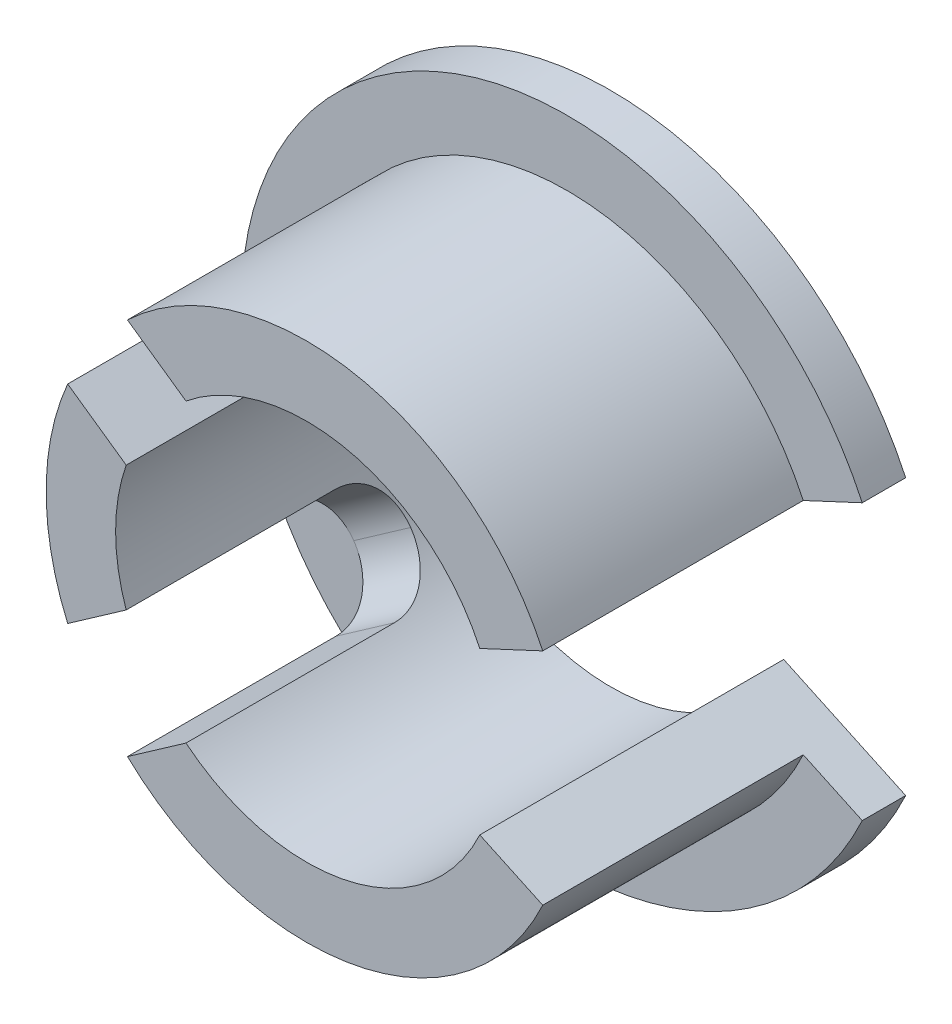
ISO-10303-21;
HEADER;
FILE_DESCRIPTION(('STEP AP214'),'2;1');
FILE_NAME('part.step','',(''),(''),'','','');
FILE_SCHEMA(('AUTOMOTIVE_DESIGN { 1 0 10303 214 1 1 1 1 }'));
ENDSEC;
DATA;
#1=APPLICATION_CONTEXT('core data for automotive mechanical design processes');
#2=APPLICATION_PROTOCOL_DEFINITION('international standard','automotive_design',2000,#1);
#3=PRODUCT_CONTEXT('',#1,'mechanical');
#4=PRODUCT('Part','Part','',(#3));
#5=PRODUCT_RELATED_PRODUCT_CATEGORY('part','',(#4));
#6=PRODUCT_DEFINITION_FORMATION('','',#4);
#7=PRODUCT_DEFINITION_CONTEXT('part definition',#1,'design');
#8=PRODUCT_DEFINITION('design','',#6,#7);
#9=PRODUCT_DEFINITION_SHAPE('','',#8);
#10=(LENGTH_UNIT() NAMED_UNIT(*) SI_UNIT(.MILLI.,.METRE.));
#11=(NAMED_UNIT(*) PLANE_ANGLE_UNIT() SI_UNIT($,.RADIAN.));
#12=(NAMED_UNIT(*) SI_UNIT($,.STERADIAN.) SOLID_ANGLE_UNIT());
#13=UNCERTAINTY_MEASURE_WITH_UNIT(LENGTH_MEASURE(1.E-05),#10,'distance_accuracy_value','');
#14=(GEOMETRIC_REPRESENTATION_CONTEXT(3) GLOBAL_UNCERTAINTY_ASSIGNED_CONTEXT((#13)) GLOBAL_UNIT_ASSIGNED_CONTEXT((#10,
#11,#12)) REPRESENTATION_CONTEXT('',''));
#15=CARTESIAN_POINT('',(0.,0.,0.));
#16=DIRECTION('',(0.,0.,1.));
#17=DIRECTION('',(1.,0.,0.));
#18=AXIS2_PLACEMENT_3D('',#15,#16,#17);
#19=CARTESIAN_POINT('',(0.,0.,6.));
#20=DIRECTION('',(0.,0.,-1.));
#21=DIRECTION('',(-1.,0.,0.));
#22=AXIS2_PLACEMENT_3D('',#19,#20,#21);
#23=CYLINDRICAL_SURFACE('',#22,6.);
#24=DIRECTION('',(0.,0.,-1.));
#25=VECTOR('',#24,1.);
#26=CARTESIAN_POINT('',(-4.12731914901655,4.35490948725243,6.));
#27=LINE('',#26,#25);
#28=CARTESIAN_POINT('',(-4.12731914901656,4.35490948725243,6.));
#29=VERTEX_POINT('',#28);
#30=CARTESIAN_POINT('',(-4.12731914901655,4.35490948725243,1.2));
#31=VERTEX_POINT('',#30);
#32=EDGE_CURVE('E290',#29,#31,#27,.T.);
#33=ORIENTED_EDGE('',*,*,#32,.F.);
#34=CARTESIAN_POINT('',(0.,0.,6.));
#35=DIRECTION('',(0.,0.,1.));
#36=DIRECTION('',(1.,0.,0.));
#37=AXIS2_PLACEMENT_3D('',#34,#35,#36);
#38=CIRCLE('',#37,6.);
#39=CARTESIAN_POINT('',(5.4378467222199,2.53570957044419,6.));
#40=VERTEX_POINT('',#39);
#41=EDGE_CURVE('E323',#40,#29,#38,.T.);
#42=ORIENTED_EDGE('',*,*,#41,.F.);
#43=DIRECTION('',(0.,0.,-1.));
#44=VECTOR('',#43,1.);
#45=CARTESIAN_POINT('',(5.4378467222199,2.53570957044419,6.));
#46=LINE('',#45,#44);
#47=CARTESIAN_POINT('',(5.43784672221998,2.5357095704442,0.));
#48=VERTEX_POINT('',#47);
#49=EDGE_CURVE('E185',#40,#48,#46,.T.);
#50=ORIENTED_EDGE('',*,*,#49,.T.);
#51=CARTESIAN_POINT('',(0.,0.,0.));
#52=DIRECTION('',(0.,0.,1.));
#53=DIRECTION('',(1.,0.,0.));
#54=AXIS2_PLACEMENT_3D('',#51,#52,#53);
#55=CIRCLE('',#54,6.);
#56=CARTESIAN_POINT('',(-4.91491226573395,3.44145861810628,0.));
#57=VERTEX_POINT('',#56);
#58=EDGE_CURVE('E186',#48,#57,#55,.T.);
#59=ORIENTED_EDGE('',*,*,#58,.T.);
#60=CARTESIAN_POINT('',(-4.91491226573395,3.44145861810628,0.));
#61=CARTESIAN_POINT('',(-4.89575145032598,3.46882579019035,-1.59771084222315E-07));
#62=CARTESIAN_POINT('',(-4.87636861824559,3.49601758269154,0.00139600961325699));
#63=CARTESIAN_POINT('',(-4.83729433267939,3.54988562956387,0.00696337264434701));
#64=CARTESIAN_POINT('',(-4.81760291606424,3.57656194468808,0.0111342371933441));
#65=CARTESIAN_POINT('',(-4.75835835430503,3.65545188131099,0.0277558787015132));
#66=CARTESIAN_POINT('',(-4.71854021499501,3.70666143818073,0.0443159057384285));
#67=CARTESIAN_POINT('',(-4.63962162793902,3.80498331681775,0.0878881215790612));
#68=CARTESIAN_POINT('',(-4.60052128919286,3.8520950203103,0.114901884279739));
#69=CARTESIAN_POINT('',(-4.52440989272803,3.94121178417932,0.178592168364046));
#70=CARTESIAN_POINT('',(-4.48739907621217,3.98321625564837,0.215269802533157));
#71=CARTESIAN_POINT('',(-4.41644252202698,4.0617576610809,0.29776354323522));
#72=CARTESIAN_POINT('',(-4.38253882352298,4.09822305281015,0.343683880799866));
#73=CARTESIAN_POINT('',(-4.31967543669473,4.16443190637797,0.443144716802443));
#74=CARTESIAN_POINT('',(-4.29071674648372,4.19417401156235,0.496686749633547));
#75=CARTESIAN_POINT('',(-4.23877070885304,4.24666978285593,0.610475385188785));
#76=CARTESIAN_POINT('',(-4.215841701988,4.26935553373821,0.670779974596941));
#77=CARTESIAN_POINT('',(-4.17742223680119,4.30695605382336,0.795985141129957));
#78=CARTESIAN_POINT('',(-4.16192645327083,4.32187638687429,0.860882389680752));
#79=CARTESIAN_POINT('',(-4.14285537171515,4.34014556287068,0.971789197498264));
#80=CARTESIAN_POINT('',(-4.13704228704735,4.3456795559701,1.01707779734613));
#81=CARTESIAN_POINT('',(-4.12926990479884,4.3530607429089,1.10823688766553));
#82=CARTESIAN_POINT('',(-4.12730689641615,4.35491148678339,1.15410677490711));
#83=CARTESIAN_POINT('',(-4.12731914901655,4.35490948725243,1.2));
#84=B_SPLINE_CURVE_WITH_KNOTS('',3,(#60,#61,#62,#63,#64,#65,#66,#67,#68,#69,#70,#71,#72,#73,#74,
#75,#76,#77,#78,#79,#80,#81,#82,#83),.UNSPECIFIED.,.F.,.F.,(4,2,2,2,2,2,2,2,2,2,2,4),(0.,
0.100161626240136,0.200311374746478,0.400122720254603,0.599964160736359,0.799828622831668,
1.0020878512882,1.20438785613811,1.40857864720857,1.61262293541136,1.75031180360672,
1.88786789840738),.UNSPECIFIED.);
#85=EDGE_CURVE('E260',#57,#31,#84,.T.);
#86=ORIENTED_EDGE('',*,*,#85,.T.);
#87=EDGE_LOOP('',(#33,#42,#50,#59,#86));
#88=FACE_BOUND('',#87,.T.);
#89=ADVANCED_FACE('F38',(#88),#23,.T.);
#90=CARTESIAN_POINT('',(-5.50390259625907,2.38894458095885,6.));
#91=VERTEX_POINT('',#90);
#92=CARTESIAN_POINT('',(-5.50390259625914,-2.3889445809589,6.));
#93=VERTEX_POINT('',#92);
#94=EDGE_CURVE('E289',#91,#93,#38,.T.);
#95=ORIENTED_EDGE('',*,*,#94,.F.);
#96=DIRECTION('',(0.,0.,-1.));
#97=VECTOR('',#96,1.);
#98=CARTESIAN_POINT('',(-5.50390259625907,2.38894458095885,6.));
#99=LINE('',#98,#97);
#100=CARTESIAN_POINT('',(-5.50390259625907,2.38894458095885,1.2));
#101=VERTEX_POINT('',#100);
#102=EDGE_CURVE('E166',#91,#101,#99,.T.);
#103=ORIENTED_EDGE('',*,*,#102,.T.);
#104=CARTESIAN_POINT('',(-5.50390259625907,2.38894458095885,1.2));
#105=CARTESIAN_POINT('',(-5.50390129259065,2.38894345077499,1.16659870671718));
#106=CARTESIAN_POINT('',(-5.50333568249593,2.39025114416916,1.13321375465329));
#107=CARTESIAN_POINT('',(-5.50107139173821,2.39545935136833,1.06668951971157));
#108=CARTESIAN_POINT('',(-5.49937285136066,2.39935954415608,1.03355020693102));
#109=CARTESIAN_POINT('',(-5.49258213134487,2.41488654343475,0.93497014502562));
#110=CARTESIAN_POINT('',(-5.48579487721516,2.43034003994238,0.870200379803861));
#111=CARTESIAN_POINT('',(-5.46768118655352,2.47081922280248,0.744429729103898));
#112=CARTESIAN_POINT('',(-5.45635417239523,2.4958461272301,0.683429324368956));
#113=CARTESIAN_POINT('',(-5.4291419956572,2.55449773971153,0.566803623035975));
#114=CARTESIAN_POINT('',(-5.41325623909368,2.58812356810454,0.51117902814529));
#115=CARTESIAN_POINT('',(-5.37671305831478,2.66321556690927,0.406129110511558));
#116=CARTESIAN_POINT('',(-5.35599833416981,2.70477470554033,0.356790206461739));
#117=CARTESIAN_POINT('',(-5.30999572208968,2.79400432190847,0.266456004446862));
#118=CARTESIAN_POINT('',(-5.28470697172865,2.84167595165242,0.225462283057131));
#119=CARTESIAN_POINT('',(-5.22954064099911,2.94197318512805,0.152643414537148));
#120=CARTESIAN_POINT('',(-5.19962395927408,2.99463936483645,0.120903746376848));
#121=CARTESIAN_POINT('',(-5.13581334917512,3.10279744700854,0.0680561743011082));
#122=CARTESIAN_POINT('',(-5.10192223172316,3.15828733686545,0.0469408115924753));
#123=CARTESIAN_POINT('',(-5.04243943833129,3.25204706793954,0.0210222271502228));
#124=CARTESIAN_POINT('',(-5.0177283325669,3.29005485945234,0.0131482208937326));
#125=CARTESIAN_POINT('',(-4.96713428585142,3.36595884608023,0.00263537222736853));
#126=CARTESIAN_POINT('',(-4.94125252595846,3.40385511432645,-8.63126073076088E-06));
#127=CARTESIAN_POINT('',(-4.91491226573395,3.44145861810628,0.));
#128=B_SPLINE_CURVE_WITH_KNOTS('',3,(#104,#105,#106,#107,#108,#109,#110,#111,#112,#113,#114,
#115,#116,#117,#118,#119,#120,#121,#122,#123,#124,#125,#126,#127),.UNSPECIFIED.,.F.,.F.,(4,2,2,
2,2,2,2,2,2,2,2,4),(0.,0.100141242952308,0.200270088185873,0.400033576783349,0.599822490800818,
0.799637448249877,1.00195631609977,1.20431337071424,1.40848431084597,1.6125117120772,
1.75025786626582,1.88786802166453),.UNSPECIFIED.);
#129=EDGE_CURVE('E11',#101,#57,#128,.T.);
#130=ORIENTED_EDGE('',*,*,#129,.T.);
#131=CARTESIAN_POINT('',(-4.91491226573395,-3.44145861810628,0.));
#132=VERTEX_POINT('',#131);
#133=EDGE_CURVE('E190',#57,#132,#55,.T.);
#134=ORIENTED_EDGE('',*,*,#133,.T.);
#135=CARTESIAN_POINT('',(-4.91491226573395,-3.44145861810628,0.));
#136=CARTESIAN_POINT('',(-4.93407561056105,-3.41409321714057,-1.59771084213976E-07));
#137=CARTESIAN_POINT('',(-4.95299821831417,-3.38657917209615,0.00139600961325702));
#138=CARTESIAN_POINT('',(-4.99025343170655,-3.33143739717516,0.0069633726443471));
#139=CARTESIAN_POINT('',(-5.00858610704553,-3.30380968116691,0.0111342371933442));
#140=CARTESIAN_POINT('',(-5.0624555648402,-3.22115605622935,0.0277558787015134));
#141=CARTESIAN_POINT('',(-5.09695820183063,-3.16622454456607,0.0443159057384286));
#142=CARTESIAN_POINT('',(-5.1623587991917,-3.05843726764323,0.0878881215790616));
#143=CARTESIAN_POINT('',(-5.19325621585426,-3.00558181627239,0.114901884279739));
#144=CARTESIAN_POINT('',(-5.25096695052268,-2.90358077030547,0.178592168364047));
#145=CARTESIAN_POINT('',(-5.2777797976328,-2.8544356037841,0.215269802533158));
#146=CARTESIAN_POINT('',(-5.32731600591159,-2.76089551067685,0.297763543235221));
#147=CARTESIAN_POINT('',(-5.34998651761203,-2.71656455686963,0.343683880799868));
#148=CARTESIAN_POINT('',(-5.39070194416746,-2.63484753456282,0.443144716802445));
#149=CARTESIAN_POINT('',(-5.40874592555937,-2.59746286798594,0.496686749633549));
#150=CARTESIAN_POINT('',(-5.44030922323077,-2.5306949485235,0.610475385188786));
#151=CARTESIAN_POINT('',(-5.45378467371754,-2.50138974620226,0.670779974596943));
#152=CARTESIAN_POINT('',(-5.47597737398958,-2.45242712300303,0.79598514112996));
#153=CARTESIAN_POINT('',(-5.48469803075321,-2.43276279511771,0.860882389680754));
#154=CARTESIAN_POINT('',(-5.4953427465778,-2.40859341431671,0.971789197498266));
#155=CARTESIAN_POINT('',(-5.49855480700557,-2.40123816443734,1.01707779734614));
#156=CARTESIAN_POINT('',(-5.50283254261398,-2.39140999957777,1.10823688766553));
#157=CARTESIAN_POINT('',(-5.50390028456741,-2.3889323834008,1.15410677490711));
#158=CARTESIAN_POINT('',(-5.50390259625907,-2.38894458095885,1.2));
#159=B_SPLINE_CURVE_WITH_KNOTS('',3,(#135,#136,#137,#138,#139,#140,#141,#142,#143,#144,#145,
#146,#147,#148,#149,#150,#151,#152,#153,#154,#155,#156,#157,#158),.UNSPECIFIED.,.F.,.F.,(4,2,2,
2,2,2,2,2,2,2,2,4),(0.,0.100161626240137,0.200311374746479,0.400122720254604,0.599964160736361,
0.799828622831671,1.00208785128821,1.20438785613811,1.40857864720857,1.61262293541137,
1.75031180360672,1.88786789840738),.UNSPECIFIED.);
#160=CARTESIAN_POINT('',(-5.50390259625907,-2.38894458095885,1.2));
#161=VERTEX_POINT('',#160);
#162=EDGE_CURVE('E249',#132,#161,#159,.T.);
#163=ORIENTED_EDGE('',*,*,#162,.T.);
#164=DIRECTION('',(0.,0.,-1.));
#165=VECTOR('',#164,1.);
#166=CARTESIAN_POINT('',(-5.50390259625907,-2.38894458095885,6.));
#167=LINE('',#166,#165);
#168=EDGE_CURVE('E291',#93,#161,#167,.T.);
#169=ORIENTED_EDGE('',*,*,#168,.F.);
#170=EDGE_LOOP('',(#95,#103,#130,#134,#163,#169));
#171=FACE_BOUND('',#170,.T.);
#172=ADVANCED_FACE('F287',(#171),#23,.T.);
#173=CARTESIAN_POINT('',(0.,0.,6.));
#174=DIRECTION('',(0.,0.,-1.));
#175=DIRECTION('',(-1.,0.,0.));
#176=AXIS2_PLACEMENT_3D('',#173,#174,#175);
#177=CYLINDRICAL_SURFACE('',#176,4.4);
#178=CARTESIAN_POINT('',(-2.77934442860093,3.41104742670128,1.2));
#179=CARTESIAN_POINT('',(-2.77934208946984,3.41104642956213,1.16691195953624));
#180=CARTESIAN_POINT('',(-2.78044806810827,3.41014847760911,1.13384042834089));
#181=CARTESIAN_POINT('',(-2.78484395007547,3.40656075451807,1.06794689740856));
#182=CARTESIAN_POINT('',(-2.78813343293852,3.40387132835431,1.0351248508602));
#183=CARTESIAN_POINT('',(-2.80120111840937,3.3931411334644,0.937544671921817));
#184=CARTESIAN_POINT('',(-2.81417899722576,3.38243838194847,0.873460528770743));
#185=CARTESIAN_POINT('',(-2.84792548475399,3.35407205281836,0.74905508034611));
#186=CARTESIAN_POINT('',(-2.8686926425793,3.33640977150477,0.688733076748609));
#187=CARTESIAN_POINT('',(-2.91692919400609,3.29432020048991,0.573332670102652));
#188=CARTESIAN_POINT('',(-2.94440116899407,3.26989030473446,0.518256298028636));
#189=CARTESIAN_POINT('',(-3.00544928293861,3.21388022756531,0.413513253252814));
#190=CARTESIAN_POINT('',(-3.03915346586474,3.18214579574924,0.364003738299508));
#191=CARTESIAN_POINT('',(-3.11070271905138,3.11223812241796,0.273181489355954));
#192=CARTESIAN_POINT('',(-3.14854858002071,3.07406365064597,0.231870324804786));
#193=CARTESIAN_POINT('',(-3.22746681374527,2.99111800455882,0.157949414295823));
#194=CARTESIAN_POINT('',(-3.26858328679814,2.94624520715162,0.125500508132034));
#195=CARTESIAN_POINT('',(-3.35176078194022,2.85125808730684,0.071286701254344));
#196=CARTESIAN_POINT('',(-3.3938210074928,2.80114806346305,0.0495131207399413));
#197=CARTESIAN_POINT('',(-3.46430369789177,2.71306548347898,0.0223579106088473));
#198=CARTESIAN_POINT('',(-3.49291655628263,2.67613876857479,0.0139883088491053));
#199=CARTESIAN_POINT('',(-3.54931979753605,2.60087810735488,0.00280501864488711));
#200=CARTESIAN_POINT('',(-3.57711063165497,2.56254496001483,-1.17759816311641E-05));
#201=CARTESIAN_POINT('',(-3.60426899487156,2.52373631994461,0.));
#202=B_SPLINE_CURVE_WITH_KNOTS('',3,(#178,#179,#180,#181,#182,#183,#184,#185,#186,#187,#188,
#189,#190,#191,#192,#193,#194,#195,#196,#197,#198,#199,#200,#201),.UNSPECIFIED.,.F.,.F.,(4,2,2,
2,2,2,2,2,2,2,2,4),(0.,0.0992010519358643,0.198383006795375,0.396119348186892,0.593818876076946,
0.791594639631131,0.99400858293105,1.19646123774567,1.40237514714957,1.60812135507258,
1.75016366653038,1.89212649843722),.UNSPECIFIED.);
#203=CARTESIAN_POINT('',(-2.77934442860091,3.4110474267013,1.2));
#204=VERTEX_POINT('',#203);
#205=CARTESIAN_POINT('',(-3.60426899487156,2.52373631994461,0.));
#206=VERTEX_POINT('',#205);
#207=EDGE_CURVE('E56',#204,#206,#202,.T.);
#208=ORIENTED_EDGE('',*,*,#207,.T.);
#209=CARTESIAN_POINT('',(-3.60426899487156,2.5237363199446,0.));
#210=CARTESIAN_POINT('',(-3.62326249476011,2.49661435727148,-4.62801717651386E-07));
#211=CARTESIAN_POINT('',(-3.64193668327681,2.46928886880967,0.00137132246412852));
#212=CARTESIAN_POINT('',(-3.6785407757348,2.41441973972067,0.00683941098958863));
#213=CARTESIAN_POINT('',(-3.69647080894635,2.38687613798113,0.0109352389222312));
#214=CARTESIAN_POINT('',(-3.74888899283531,2.30435558251759,0.0272462440025316));
#215=CARTESIAN_POINT('',(-3.78212256640281,2.24932083714262,0.0434852314055239));
#216=CARTESIAN_POINT('',(-3.84449593019729,2.14097417626109,0.086159192208548));
#217=CARTESIAN_POINT('',(-3.873636155105,2.08766207828688,0.112593081873575));
#218=CARTESIAN_POINT('',(-3.92753797548014,1.98439909597685,0.174865098744966));
#219=CARTESIAN_POINT('',(-3.95229810953143,1.93444933691508,0.21070635484722));
#220=CARTESIAN_POINT('',(-3.99783874907871,1.83852368274244,0.291677724617291));
#221=CARTESIAN_POINT('',(-4.01852202351607,1.7926565864676,0.336991324501284));
#222=CARTESIAN_POINT('',(-4.05533936057842,1.70773801414955,0.435237163313999));
#223=CARTESIAN_POINT('',(-4.07147234759386,1.66868815041249,0.48817119912353));
#224=CARTESIAN_POINT('',(-4.09963709485411,1.59826320182644,0.601338516059686));
#225=CARTESIAN_POINT('',(-4.11158810146305,1.56704222192128,0.661687987042844));
#226=CARTESIAN_POINT('',(-4.13118476685181,1.51462866130817,0.787221432559325));
#227=CARTESIAN_POINT('',(-4.13883414289057,1.49342742456457,0.852401177700124));
#228=CARTESIAN_POINT('',(-4.14827613242274,1.46694888803523,0.964930002556443));
#229=CARTESIAN_POINT('',(-4.15114999820712,1.45877070953072,1.01152728918365));
#230=CARTESIAN_POINT('',(-4.15497270621325,1.44782964872516,1.105407459274));
#231=CARTESIAN_POINT('',(-4.15592246347301,1.44506419234596,1.15269000607143));
#232=CARTESIAN_POINT('',(-4.1559278758434,1.44508252040766,1.2));
#233=B_SPLINE_CURVE_WITH_KNOTS('',3,(#209,#210,#211,#212,#213,#214,#215,#216,#217,#218,#219,
#220,#221,#222,#223,#224,#225,#226,#227,#228,#229,#230,#231,#232),.UNSPECIFIED.,.F.,.F.,(4,2,2,
2,2,2,2,2,2,2,2,4),(0.,0.0992708532977199,0.1985243890479,0.396424641270461,0.594303862164045,
0.792248981392049,0.994458695968138,1.19671616945342,1.40268781625164,1.6084811978215,
1.7503374134892,1.89212615150302),.UNSPECIFIED.);
#234=CARTESIAN_POINT('',(-4.15592787584339,1.44508252040767,1.2));
#235=VERTEX_POINT('',#234);
#236=EDGE_CURVE('E48',#206,#235,#233,.T.);
#237=ORIENTED_EDGE('',*,*,#236,.T.);
#238=DIRECTION('',(0.,0.,1.));
#239=VECTOR('',#238,1.);
#240=CARTESIAN_POINT('',(-4.15592787584339,1.44508252040767,0.));
#241=LINE('',#240,#239);
#242=CARTESIAN_POINT('',(-4.15592787584339,1.44508252040767,6.));
#243=VERTEX_POINT('',#242);
#244=EDGE_CURVE('E153',#235,#243,#241,.T.);
#245=ORIENTED_EDGE('',*,*,#244,.T.);
#246=CARTESIAN_POINT('',(0.,0.,6.));
#247=DIRECTION('',(0.,0.,-1.));
#248=DIRECTION('',(-1.,0.,0.));
#249=AXIS2_PLACEMENT_3D('',#246,#247,#248);
#250=CIRCLE('',#249,4.4);
#251=CARTESIAN_POINT('',(-4.15592787584346,-1.44508252040767,6.));
#252=VERTEX_POINT('',#251);
#253=EDGE_CURVE('E157',#252,#243,#250,.T.);
#254=ORIENTED_EDGE('',*,*,#253,.F.);
#255=DIRECTION('',(0.,0.,1.));
#256=VECTOR('',#255,1.);
#257=CARTESIAN_POINT('',(-4.15592787584346,-1.44508252040767,0.));
#258=LINE('',#257,#256);
#259=CARTESIAN_POINT('',(-4.15592787584346,-1.44508252040767,1.2));
#260=VERTEX_POINT('',#259);
#261=EDGE_CURVE('E365',#260,#252,#258,.T.);
#262=ORIENTED_EDGE('',*,*,#261,.F.);
#263=CARTESIAN_POINT('',(-4.15592787584344,-1.4450825204077,1.2));
#264=CARTESIAN_POINT('',(-4.15592613880919,-1.44508066338516,1.16691195953624));
#265=CARTESIAN_POINT('',(-4.15546060695754,-1.4464270610061,1.13384042834089));
#266=CARTESIAN_POINT('',(-4.15359273022393,-1.45178491241834,1.06794689740856));
#267=CARTESIAN_POINT('',(-4.15219056570399,-1.45579585311294,1.0351248508602));
#268=CARTESIAN_POINT('',(-4.14657689240402,-1.47174540351481,0.937544671921817));
#269=CARTESIAN_POINT('',(-4.14095829175524,-1.48760117707948,0.873460528770743));
#270=CARTESIAN_POINT('',(-4.12584464009404,-1.52901435834191,0.74905508034611));
#271=CARTESIAN_POINT('',(-4.11635031097329,-1.55456995929138,0.688733076748609));
#272=CARTESIAN_POINT('',(-4.09329692391111,-1.61429297183032,0.573332670102652));
#273=CARTESIAN_POINT('',(-4.07973629996598,-1.64846370045265,0.518256298028636));
#274=CARTESIAN_POINT('',(-4.04798372844155,-1.7249867372603,0.413513253252814));
#275=CARTESIAN_POINT('',(-4.02969062651422,-1.7675121241637,0.364003738299508));
#276=CARTESIAN_POINT('',(-3.98847018757825,-1.85865626185825,0.273181489355954));
#277=CARTESIAN_POINT('',(-3.96554196494472,-1.90727617644526,0.231870324804786));
#278=CARTESIAN_POINT('',(-3.91459017899979,-2.00980414008465,0.157949414295823));
#279=CARTESIAN_POINT('',(-3.8864862044088,-2.06378838700581,0.125500508132034));
#280=CARTESIAN_POINT('',(-3.82567588763092,-2.17443717374968,0.071286701254344));
#281=CARTESIAN_POINT('',(-3.79297331236931,-2.23109949486714,0.0495131207399412));
#282=CARTESIAN_POINT('',(-3.73430926181074,-2.32745757555884,0.0223579106088471));
#283=CARTESIAN_POINT('',(-3.7093956742332,-2.3669745477724,0.013988308849105));
#284=CARTESIAN_POINT('',(-3.65796483090691,-2.44571691950386,0.00280501864488679));
#285=CARTESIAN_POINT('',(-3.63144848028846,-2.48494246979826,-1.17759816314255E-05));
#286=CARTESIAN_POINT('',(-3.60426899487156,-2.5237363199446,0.));
#287=B_SPLINE_CURVE_WITH_KNOTS('',3,(#263,#264,#265,#266,#267,#268,#269,#270,#271,#272,#273,
#274,#275,#276,#277,#278,#279,#280,#281,#282,#283,#284,#285,#286),.UNSPECIFIED.,.F.,.F.,(4,2,2,
2,2,2,2,2,2,2,2,4),(0.,0.0992010519358643,0.198383006795375,0.396119348186892,0.593818876076946,
0.791594639631131,0.99400858293105,1.19646123774567,1.40237514714957,1.60812135507258,
1.75016366653038,1.89212649843722),.UNSPECIFIED.);
#288=CARTESIAN_POINT('',(-3.60426899487156,-2.5237363199446,0.));
#289=VERTEX_POINT('',#288);
#290=EDGE_CURVE('E63',#260,#289,#287,.T.);
#291=ORIENTED_EDGE('',*,*,#290,.T.);
#292=CARTESIAN_POINT('',(-3.60426899487156,-2.5237363199446,0.));
#293=CARTESIAN_POINT('',(-3.58527884624054,-2.5508606291935,-4.62801717556786E-07));
#294=CARTESIAN_POINT('',(-3.56598823500658,-2.57775449382196,0.00137132246412866));
#295=CARTESIAN_POINT('',(-3.52694745624148,-2.63091743679047,0.00683941098958878));
#296=CARTESIAN_POINT('',(-3.50719736946582,-2.65718662330447,0.0109352389222313));
#297=CARTESIAN_POINT('',(-3.44758148720015,-2.73466729610688,0.0272462440025315));
#298=CARTESIAN_POINT('',(-3.40723229467924,-2.78471963145165,0.0434852314055236));
#299=CARTESIAN_POINT('',(-3.32675268378677,-2.88038816162647,0.0861591922085475));
#300=CARTESIAN_POINT('',(-3.28662224262126,-2.92600482733043,0.112593081873575));
#301=CARTESIAN_POINT('',(-3.20802228847441,-3.01197399019378,0.174865098744965));
#302=CARTESIAN_POINT('',(-3.16955333307101,-3.05232472920483,0.210706354847219));
#303=CARTESIAN_POINT('',(-3.09498851976602,-3.12792743812202,0.291677724617291));
#304=CARTESIAN_POINT('',(-3.05896164434718,-3.16305082932635,0.336991324501284));
#305=CARTESIAN_POINT('',(-2.99175655947118,-3.22669167155606,0.435237163313998));
#306=CARTESIAN_POINT('',(-2.96057949720606,-3.2552075603979,0.488171199123529));
#307=CARTESIAN_POINT('',(-2.9040346035952,-3.30576051657377,0.601338516059685));
#308=CARTESIAN_POINT('',(-2.87878396415789,-3.32766899331707,0.661687987042843));
#309=CARTESIAN_POINT('',(-2.83623378232561,-3.36401032868801,0.787221432559324));
#310=CARTESIAN_POINT('',(-2.81892737729523,-3.37844964093498,0.852401177700122));
#311=CARTESIAN_POINT('',(-2.79727504252248,-3.39637840168271,0.964930002556442));
#312=CARTESIAN_POINT('',(-2.79057298851779,-3.40187605393768,1.01152728918365));
#313=CARTESIAN_POINT('',(-2.78159919755538,-3.40921028762731,1.105407459274));
#314=CARTESIAN_POINT('',(-2.77932535471686,-3.41104860930302,1.15269000607143));
#315=CARTESIAN_POINT('',(-2.77934442860089,-3.41104742670124,1.2));
#316=B_SPLINE_CURVE_WITH_KNOTS('',3,(#292,#293,#294,#295,#296,#297,#298,#299,#300,#301,#302,
#303,#304,#305,#306,#307,#308,#309,#310,#311,#312,#313,#314,#315),.UNSPECIFIED.,.F.,.F.,(4,2,2,
2,2,2,2,2,2,2,2,4),(0.,0.0992708532977199,0.1985243890479,0.39642464127046,0.594303862164045,
0.792248981392048,0.994458695968138,1.19671616945342,1.40268781625164,1.6084811978215,
1.7503374134892,1.89212615150302),.UNSPECIFIED.);
#317=CARTESIAN_POINT('',(-2.77934442860088,-3.41104742670125,1.2));
#318=VERTEX_POINT('',#317);
#319=EDGE_CURVE('E211',#289,#318,#316,.T.);
#320=ORIENTED_EDGE('',*,*,#319,.T.);
#321=DIRECTION('',(0.,0.,1.));
#322=VECTOR('',#321,1.);
#323=CARTESIAN_POINT('',(-2.77934442860088,-3.41104742670125,0.));
#324=LINE('',#323,#322);
#325=CARTESIAN_POINT('',(-2.77934442860088,-3.41104742670125,6.));
#326=VERTEX_POINT('',#325);
#327=EDGE_CURVE('E362',#318,#326,#324,.T.);
#328=ORIENTED_EDGE('',*,*,#327,.T.);
#329=CARTESIAN_POINT('',(3.98775426296126,-1.85952035165907,6.));
#330=VERTEX_POINT('',#329);
#331=EDGE_CURVE('E175',#330,#326,#250,.T.);
#332=ORIENTED_EDGE('',*,*,#331,.F.);
#333=DIRECTION('',(0.,0.,-1.));
#334=VECTOR('',#333,1.);
#335=CARTESIAN_POINT('',(3.98775426296126,-1.85952035165907,6.));
#336=LINE('',#335,#334);
#337=CARTESIAN_POINT('',(3.98775426296126,-1.85952035165907,-1.));
#338=VERTEX_POINT('',#337);
#339=EDGE_CURVE('E196',#330,#338,#336,.T.);
#340=ORIENTED_EDGE('',*,*,#339,.T.);
#341=CARTESIAN_POINT('',(0.,0.,-1.));
#342=DIRECTION('',(0.,0.,-1.));
#343=DIRECTION('',(-1.00000000000002,0.,0.));
#344=AXIS2_PLACEMENT_3D('',#341,#342,#343);
#345=CIRCLE('',#344,4.4);
#346=CARTESIAN_POINT('',(3.98775426296126,1.85952035165907,-1.));
#347=VERTEX_POINT('',#346);
#348=EDGE_CURVE('E310',#347,#338,#345,.F.);
#349=ORIENTED_EDGE('',*,*,#348,.F.);
#350=DIRECTION('',(0.,0.,-1.));
#351=VECTOR('',#350,1.);
#352=CARTESIAN_POINT('',(3.98775426296126,1.85952035165907,6.));
#353=LINE('',#352,#351);
#354=CARTESIAN_POINT('',(3.98775426296126,1.85952035165907,6.));
#355=VERTEX_POINT('',#354);
#356=EDGE_CURVE('E194',#355,#347,#353,.T.);
#357=ORIENTED_EDGE('',*,*,#356,.F.);
#358=CARTESIAN_POINT('',(-2.77934442860091,3.4110474267013,6.));
#359=VERTEX_POINT('',#358);
#360=EDGE_CURVE('E176',#359,#355,#250,.T.);
#361=ORIENTED_EDGE('',*,*,#360,.F.);
#362=DIRECTION('',(0.,0.,1.));
#363=VECTOR('',#362,1.);
#364=CARTESIAN_POINT('',(-2.77934442860091,3.4110474267013,0.));
#365=LINE('',#364,#363);
#366=EDGE_CURVE('E160',#204,#359,#365,.T.);
#367=ORIENTED_EDGE('',*,*,#366,.F.);
#368=EDGE_LOOP('',(#208,#237,#245,#254,#262,#291,#320,#328,#332,#340,#349,#357,#361,#367));
#369=FACE_BOUND('',#368,.T.);
#370=ADVANCED_FACE('F155',(#369),#177,.F.);
#371=CARTESIAN_POINT('',(0.,0.,6.));
#372=DIRECTION('',(0.,0.,1.));
#373=DIRECTION('',(1.,0.,0.));
#374=AXIS2_PLACEMENT_3D('',#371,#372,#373);
#375=PLANE('',#374);
#376=ORIENTED_EDGE('',*,*,#41,.T.);
#377=DIRECTION('',(0.819152044288991,-0.573576436351047,0.));
#378=VECTOR('',#377,1.);
#379=CARTESIAN_POINT('',(0.68829172362126,0.982982453146789,6.));
#380=LINE('',#379,#378);
#381=EDGE_CURVE('E170',#29,#359,#380,.T.);
#382=ORIENTED_EDGE('',*,*,#381,.T.);
#383=ORIENTED_EDGE('',*,*,#360,.T.);
#384=DIRECTION('',(0.90630778703665,0.422618261740698,0.));
#385=VECTOR('',#384,1.);
#386=CARTESIAN_POINT('',(3.98775426296126,1.85952035165907,6.));
#387=LINE('',#386,#385);
#388=EDGE_CURVE('E179',#355,#40,#387,.T.);
#389=ORIENTED_EDGE('',*,*,#388,.T.);
#390=EDGE_LOOP('',(#376,#382,#383,#389));
#391=FACE_BOUND('',#390,.T.);
#392=ADVANCED_FACE('F373',(#391),#375,.T.);
#393=DIRECTION('',(0.819152044288991,-0.573576436351047,0.));
#394=VECTOR('',#393,1.);
#395=CARTESIAN_POINT('',(-0.688291723621261,-0.982982453146794,6.));
#396=LINE('',#395,#394);
#397=EDGE_CURVE('E161',#91,#243,#396,.T.);
#398=ORIENTED_EDGE('',*,*,#397,.F.);
#399=ORIENTED_EDGE('',*,*,#94,.T.);
#400=DIRECTION('',(0.819152044288997,0.573576436351052,0.));
#401=VECTOR('',#400,1.);
#402=CARTESIAN_POINT('',(-0.688291723621261,0.982982453146791,6.));
#403=LINE('',#402,#401);
#404=EDGE_CURVE('E174',#93,#252,#403,.T.);
#405=ORIENTED_EDGE('',*,*,#404,.T.);
#406=ORIENTED_EDGE('',*,*,#253,.T.);
#407=EDGE_LOOP('',(#398,#399,#405,#406));
#408=FACE_BOUND('',#407,.T.);
#409=ADVANCED_FACE('F173',(#408),#375,.T.);
#410=CARTESIAN_POINT('',(-4.12731914901656,-4.35490948725243,6.));
#411=VERTEX_POINT('',#410);
#412=CARTESIAN_POINT('',(5.4378467222199,-2.53570957044419,6.));
#413=VERTEX_POINT('',#412);
#414=EDGE_CURVE('E189',#411,#413,#38,.T.);
#415=ORIENTED_EDGE('',*,*,#414,.F.);
#416=DIRECTION('',(0.,0.,-1.));
#417=VECTOR('',#416,1.);
#418=CARTESIAN_POINT('',(-4.12731914901656,-4.35490948725243,6.));
#419=LINE('',#418,#417);
#420=CARTESIAN_POINT('',(-4.12731914901656,-4.35490948725243,1.2));
#421=VERTEX_POINT('',#420);
#422=EDGE_CURVE('E297',#411,#421,#419,.T.);
#423=ORIENTED_EDGE('',*,*,#422,.T.);
#424=CARTESIAN_POINT('',(-4.12731914901656,-4.35490948725243,1.2));
#425=CARTESIAN_POINT('',(-4.12731764111027,-4.35490864875048,1.16659870671718));
#426=CARTESIAN_POINT('',(-4.12835302089736,-4.35392989163612,1.13321375465329));
#427=CARTESIAN_POINT('',(-4.13247270172045,-4.35002084254705,1.06668951971157));
#428=CARTESIAN_POINT('',(-4.13555674907937,-4.34709079219189,1.03355020693102));
#429=CARTESIAN_POINT('',(-4.14782479269141,-4.33539905618453,0.934970145025619));
#430=CARTESIAN_POINT('',(-4.16002495169474,-4.32373571647302,0.870200379803861));
#431=CARTESIAN_POINT('',(-4.19186769404757,-4.29286971909956,0.744429729103899));
#432=CARTESIAN_POINT('',(-4.21151122445344,-4.27366610204015,0.683429324368956));
#433=CARTESIAN_POINT('',(-4.2573185993113,-4.22803498745671,0.566803623035975));
#434=CARTESIAN_POINT('',(-4.28348329338332,-4.20160654859195,0.511179028145291));
#435=CARTESIAN_POINT('',(-4.34154818661262,-4.14158421508017,0.406129110511559));
#436=CARTESIAN_POINT('',(-4.37351614958943,-4.10790467910844,0.356790206461739));
#437=CARTESIAN_POINT('',(-4.44163074166912,-4.03415803782074,0.266456004446862));
#438=CARTESIAN_POINT('',(-4.47777815833735,-3.99408972807999,0.225462283057131));
#439=CARTESIAN_POINT('',(-4.55315873217677,-3.90794666000911,0.152643414537148));
#440=CARTESIAN_POINT('',(-4.59241664484231,-3.86182128062141,0.120903746376848));
#441=CARTESIAN_POINT('',(-4.67222748252604,-3.76486667841724,0.068056174301108));
#442=CARTESIAN_POINT('',(-4.71277947770442,-3.71404078535546,0.0469408115924753));
#443=CARTESIAN_POINT('',(-4.78054049160031,-3.62607752668126,0.0210222271502227));
#444=CARTESIAN_POINT('',(-4.80780443688198,-3.5898572526423,0.0131482208937325));
#445=CARTESIAN_POINT('',(-4.86182666989539,-3.5163537079026,0.00263537222736837));
#446=CARTESIAN_POINT('',(-4.88858543029357,-3.47907152202116,-8.63126073093038E-06));
#447=CARTESIAN_POINT('',(-4.91491226573395,-3.44145861810627,0.));
#448=B_SPLINE_CURVE_WITH_KNOTS('',3,(#424,#425,#426,#427,#428,#429,#430,#431,#432,#433,#434,
#435,#436,#437,#438,#439,#440,#441,#442,#443,#444,#445,#446,#447),.UNSPECIFIED.,.F.,.F.,(4,2,2,
2,2,2,2,2,2,2,2,4),(0.,0.100141242952308,0.200270088185874,0.400033576783349,0.599822490800817,
0.799637448249877,1.00195631609977,1.20431337071424,1.40848431084597,1.6125117120772,
1.75025786626582,1.88786802166453),.UNSPECIFIED.);
#449=EDGE_CURVE('E219',#421,#132,#448,.T.);
#450=ORIENTED_EDGE('',*,*,#449,.T.);
#451=CARTESIAN_POINT('',(5.4378467222199,-2.53570957044419,0.));
#452=VERTEX_POINT('',#451);
#453=EDGE_CURVE('E191',#132,#452,#55,.T.);
#454=ORIENTED_EDGE('',*,*,#453,.T.);
#455=DIRECTION('',(0.,0.,-1.));
#456=VECTOR('',#455,1.);
#457=CARTESIAN_POINT('',(5.4378467222199,-2.53570957044419,6.));
#458=LINE('',#457,#456);
#459=EDGE_CURVE('E198',#413,#452,#458,.T.);
#460=ORIENTED_EDGE('',*,*,#459,.F.);
#461=EDGE_LOOP('',(#415,#423,#450,#454,#460));
#462=FACE_BOUND('',#461,.T.);
#463=ADVANCED_FACE('F235',(#462),#23,.T.);
#464=CARTESIAN_POINT('',(5.4378467222199,-2.53570957044419,6.));
#465=DIRECTION('',(-0.422618261740698,-0.90630778703665,0.));
#466=DIRECTION('',(0.906307787036651,-0.422618261740698,0.));
#467=AXIS2_PLACEMENT_3D('',#464,#465,#466);
#468=PLANE('',#467);
#469=ORIENTED_EDGE('',*,*,#459,.T.);
#470=DIRECTION('',(0.906307787036659,-0.4226182617407,0.));
#471=VECTOR('',#470,1.);
#472=CARTESIAN_POINT('',(0.,0.,0.));
#473=LINE('',#472,#471);
#474=CARTESIAN_POINT('',(6.79730840277488,-3.16963696305524,0.));
#475=VERTEX_POINT('',#474);
#476=EDGE_CURVE('E294',#452,#475,#473,.T.);
#477=ORIENTED_EDGE('',*,*,#476,.T.);
#478=DIRECTION('',(0.,0.,1.));
#479=VECTOR('',#478,1.);
#480=CARTESIAN_POINT('',(6.79730840277488,-3.16963696305524,-1.));
#481=LINE('',#480,#479);
#482=CARTESIAN_POINT('',(6.79730840277488,-3.16963696305524,-1.));
#483=VERTEX_POINT('',#482);
#484=EDGE_CURVE('E321',#483,#475,#481,.T.);
#485=ORIENTED_EDGE('',*,*,#484,.F.);
#486=DIRECTION('',(0.906307787036659,-0.4226182617407,0.));
#487=VECTOR('',#486,1.);
#488=CARTESIAN_POINT('',(0.,0.,-1.));
#489=LINE('',#488,#487);
#490=EDGE_CURVE('E301',#338,#483,#489,.T.);
#491=ORIENTED_EDGE('',*,*,#490,.F.);
#492=ORIENTED_EDGE('',*,*,#339,.F.);
#493=DIRECTION('',(-0.90630778703665,0.422618261740698,0.));
#494=VECTOR('',#493,1.);
#495=CARTESIAN_POINT('',(5.4378467222199,-2.53570957044419,6.));
#496=LINE('',#495,#494);
#497=EDGE_CURVE('E180',#413,#330,#496,.T.);
#498=ORIENTED_EDGE('',*,*,#497,.F.);
#499=EDGE_LOOP('',(#469,#477,#485,#491,#492,#498));
#500=FACE_BOUND('',#499,.T.);
#501=ADVANCED_FACE('F339',(#500),#468,.F.);
#502=CARTESIAN_POINT('',(3.98775426296126,1.85952035165907,6.));
#503=DIRECTION('',(-0.422618261740698,0.90630778703665,0.));
#504=DIRECTION('',(-0.906307787036651,-0.422618261740698,0.));
#505=AXIS2_PLACEMENT_3D('',#502,#503,#504);
#506=PLANE('',#505);
#507=ORIENTED_EDGE('',*,*,#356,.T.);
#508=DIRECTION('',(-0.906307787036663,-0.4226182617407,0.));
#509=VECTOR('',#508,1.);
#510=CARTESIAN_POINT('',(0.,0.,-1.));
#511=LINE('',#510,#509);
#512=CARTESIAN_POINT('',(6.79730840277493,3.16963696305524,-1.));
#513=VERTEX_POINT('',#512);
#514=EDGE_CURVE('E307',#513,#347,#511,.T.);
#515=ORIENTED_EDGE('',*,*,#514,.F.);
#516=DIRECTION('',(0.,0.,1.));
#517=VECTOR('',#516,1.);
#518=CARTESIAN_POINT('',(6.79730840277493,3.16963696305524,-1.));
#519=LINE('',#518,#517);
#520=CARTESIAN_POINT('',(6.79730840277493,3.16963696305524,0.));
#521=VERTEX_POINT('',#520);
#522=EDGE_CURVE('E313',#513,#521,#519,.T.);
#523=ORIENTED_EDGE('',*,*,#522,.T.);
#524=DIRECTION('',(-0.906307787036663,-0.4226182617407,0.));
#525=VECTOR('',#524,1.);
#526=CARTESIAN_POINT('',(0.,0.,0.));
#527=LINE('',#526,#525);
#528=EDGE_CURVE('E305',#521,#48,#527,.T.);
#529=ORIENTED_EDGE('',*,*,#528,.T.);
#530=ORIENTED_EDGE('',*,*,#49,.F.);
#531=ORIENTED_EDGE('',*,*,#388,.F.);
#532=EDGE_LOOP('',(#507,#515,#523,#529,#530,#531));
#533=FACE_BOUND('',#532,.T.);
#534=ADVANCED_FACE('F379',(#533),#506,.F.);
#535=DIRECTION('',(0.819152044288995,0.573576436351048,0.));
#536=VECTOR('',#535,1.);
#537=CARTESIAN_POINT('',(0.688291723621257,-0.982982453146788,6.));
#538=LINE('',#537,#536);
#539=EDGE_CURVE('E277',#411,#326,#538,.T.);
#540=ORIENTED_EDGE('',*,*,#539,.F.);
#541=ORIENTED_EDGE('',*,*,#414,.T.);
#542=ORIENTED_EDGE('',*,*,#497,.T.);
#543=ORIENTED_EDGE('',*,*,#331,.T.);
#544=EDGE_LOOP('',(#540,#541,#542,#543));
#545=FACE_BOUND('',#544,.T.);
#546=ADVANCED_FACE('F332',(#545),#375,.T.);
#547=CARTESIAN_POINT('',(0.,0.,-1.));
#548=DIRECTION('',(0.,0.,1.));
#549=DIRECTION('',(1.,0.,0.));
#550=AXIS2_PLACEMENT_3D('',#547,#548,#549);
#551=CYLINDRICAL_SURFACE('',#550,7.5);
#552=CARTESIAN_POINT('',(0.,0.,0.));
#553=DIRECTION('',(0.,0.,-1.));
#554=DIRECTION('',(-1.00000000000002,0.,0.));
#555=AXIS2_PLACEMENT_3D('',#552,#553,#554);
#556=CIRCLE('',#555,7.5);
#557=EDGE_CURVE('E315',#475,#521,#556,.T.);
#558=ORIENTED_EDGE('',*,*,#557,.T.);
#559=ORIENTED_EDGE('',*,*,#522,.F.);
#560=CARTESIAN_POINT('',(0.,0.,-1.));
#561=DIRECTION('',(0.,0.,-1.));
#562=DIRECTION('',(-1.00000000000002,0.,0.));
#563=AXIS2_PLACEMENT_3D('',#560,#561,#562);
#564=CIRCLE('',#563,7.5);
#565=EDGE_CURVE('E304',#483,#513,#564,.T.);
#566=ORIENTED_EDGE('',*,*,#565,.F.);
#567=ORIENTED_EDGE('',*,*,#484,.T.);
#568=EDGE_LOOP('',(#558,#559,#566,#567));
#569=FACE_BOUND('',#568,.T.);
#570=ADVANCED_FACE('F352',(#569),#551,.T.);
#571=CARTESIAN_POINT('',(0.,0.,-1.));
#572=DIRECTION('',(0.,0.,-1.));
#573=DIRECTION('',(-1.00000000000002,0.,0.));
#574=AXIS2_PLACEMENT_3D('',#571,#572,#573);
#575=PLANE('',#574);
#576=ORIENTED_EDGE('',*,*,#490,.T.);
#577=ORIENTED_EDGE('',*,*,#565,.T.);
#578=ORIENTED_EDGE('',*,*,#514,.T.);
#579=ORIENTED_EDGE('',*,*,#348,.T.);
#580=EDGE_LOOP('',(#576,#577,#578,#579));
#581=FACE_BOUND('',#580,.T.);
#582=ADVANCED_FACE('F356',(#581),#575,.T.);
#583=CARTESIAN_POINT('',(0.,0.,0.));
#584=DIRECTION('',(0.,0.,-1.));
#585=DIRECTION('',(-1.00000000000002,0.,0.));
#586=AXIS2_PLACEMENT_3D('',#583,#584,#585);
#587=PLANE('',#586);
#588=ORIENTED_EDGE('',*,*,#453,.F.);
#589=ORIENTED_EDGE('',*,*,#133,.F.);
#590=ORIENTED_EDGE('',*,*,#58,.F.);
#591=ORIENTED_EDGE('',*,*,#528,.F.);
#592=ORIENTED_EDGE('',*,*,#557,.F.);
#593=ORIENTED_EDGE('',*,*,#476,.F.);
#594=EDGE_LOOP('',(#588,#589,#590,#591,#592,#593));
#595=FACE_BOUND('',#594,.T.);
#596=ADVANCED_FACE('F348',(#595),#587,.F.);
#597=CARTESIAN_POINT('',(-0.688291723621261,0.982982453146791,0.));
#598=DIRECTION('',(0.573576436351047,-0.819152044288991,0.));
#599=DIRECTION('',(0.819152044288991,0.573576436351047,0.));
#600=AXIS2_PLACEMENT_3D('',#597,#598,#599);
#601=PLANE('',#600);
#602=ORIENTED_EDGE('',*,*,#168,.T.);
#603=DIRECTION('',(0.819152044288991,0.573576436351047,0.));
#604=VECTOR('',#603,1.);
#605=CARTESIAN_POINT('',(-0.688291723621261,0.982982453146791,1.2));
#606=LINE('',#605,#604);
#607=EDGE_CURVE('E204',#161,#260,#606,.T.);
#608=ORIENTED_EDGE('',*,*,#607,.T.);
#609=ORIENTED_EDGE('',*,*,#261,.T.);
#610=ORIENTED_EDGE('',*,*,#404,.F.);
#611=EDGE_LOOP('',(#602,#608,#609,#610));
#612=FACE_BOUND('',#611,.T.);
#613=ADVANCED_FACE('F402',(#612),#601,.T.);
#614=CARTESIAN_POINT('',(0.688291723621257,-0.982982453146788,0.));
#615=DIRECTION('',(0.573576436351046,-0.819152044288992,0.));
#616=DIRECTION('',(0.819152044288992,0.573576436351046,0.));
#617=AXIS2_PLACEMENT_3D('',#614,#615,#616);
#618=PLANE('',#617);
#619=ORIENTED_EDGE('',*,*,#327,.F.);
#620=DIRECTION('',(0.819152044288992,0.573576436351046,0.));
#621=VECTOR('',#620,1.);
#622=CARTESIAN_POINT('',(-4.1273191490166,-4.35490948725245,1.2));
#623=LINE('',#622,#621);
#624=EDGE_CURVE('E201',#318,#421,#623,.F.);
#625=ORIENTED_EDGE('',*,*,#624,.T.);
#626=ORIENTED_EDGE('',*,*,#422,.F.);
#627=ORIENTED_EDGE('',*,*,#539,.T.);
#628=EDGE_LOOP('',(#619,#625,#626,#627));
#629=FACE_BOUND('',#628,.T.);
#630=ADVANCED_FACE('F367',(#629),#618,.F.);
#631=CARTESIAN_POINT('',(0.68829172362126,0.982982453146789,0.));
#632=DIRECTION('',(-0.573576436351047,-0.819152044288991,0.));
#633=DIRECTION('',(0.819152044288991,-0.573576436351047,0.));
#634=AXIS2_PLACEMENT_3D('',#631,#632,#633);
#635=PLANE('',#634);
#636=ORIENTED_EDGE('',*,*,#32,.T.);
#637=DIRECTION('',(0.819152044288991,-0.573576436351047,0.));
#638=VECTOR('',#637,1.);
#639=CARTESIAN_POINT('',(0.68829172362126,0.982982453146789,1.2));
#640=LINE('',#639,#638);
#641=EDGE_CURVE('E206',#31,#204,#640,.T.);
#642=ORIENTED_EDGE('',*,*,#641,.T.);
#643=ORIENTED_EDGE('',*,*,#366,.T.);
#644=ORIENTED_EDGE('',*,*,#381,.F.);
#645=EDGE_LOOP('',(#636,#642,#643,#644));
#646=FACE_BOUND('',#645,.T.);
#647=ADVANCED_FACE('F375',(#646),#635,.T.);
#648=CARTESIAN_POINT('',(-0.688291723621261,-0.982982453146794,0.));
#649=DIRECTION('',(-0.573576436351047,-0.819152044288991,0.));
#650=DIRECTION('',(0.819152044288991,-0.573576436351047,0.));
#651=AXIS2_PLACEMENT_3D('',#648,#649,#650);
#652=PLANE('',#651);
#653=ORIENTED_EDGE('',*,*,#244,.F.);
#654=DIRECTION('',(0.819152044288991,-0.573576436351047,0.));
#655=VECTOR('',#654,1.);
#656=CARTESIAN_POINT('',(-5.50390259625907,2.38894458095885,1.2));
#657=LINE('',#656,#655);
#658=EDGE_CURVE('E209',#235,#101,#657,.F.);
#659=ORIENTED_EDGE('',*,*,#658,.T.);
#660=ORIENTED_EDGE('',*,*,#102,.F.);
#661=ORIENTED_EDGE('',*,*,#397,.T.);
#662=EDGE_LOOP('',(#653,#659,#660,#661));
#663=FACE_BOUND('',#662,.T.);
#664=ADVANCED_FACE('F164',(#663),#652,.F.);
#665=CARTESIAN_POINT('',(0.,0.,1.2));
#666=DIRECTION('',(0.819152044288991,0.573576436351047,0.));
#667=DIRECTION('',(-0.573576436351047,0.819152044288991,0.));
#668=AXIS2_PLACEMENT_3D('',#665,#666,#667);
#669=CYLINDRICAL_SURFACE('',#668,1.2);
#670=ORIENTED_EDGE('',*,*,#607,.F.);
#671=ORIENTED_EDGE('',*,*,#162,.F.);
#672=DIRECTION('',(0.819152044288991,0.573576436351047,0.));
#673=VECTOR('',#672,1.);
#674=CARTESIAN_POINT('',(0.,0.,0.));
#675=LINE('',#674,#673);
#676=EDGE_CURVE('E274',#289,#132,#675,.F.);
#677=ORIENTED_EDGE('',*,*,#676,.F.);
#678=ORIENTED_EDGE('',*,*,#290,.F.);
#679=EDGE_LOOP('',(#670,#671,#677,#678));
#680=FACE_BOUND('',#679,.T.);
#681=ADVANCED_FACE('F233',(#680),#669,.F.);
#682=CARTESIAN_POINT('',(0.,0.,1.2));
#683=DIRECTION('',(-0.819152044288992,-0.573576436351046,0.));
#684=DIRECTION('',(0.573576436351046,-0.819152044288992,0.));
#685=AXIS2_PLACEMENT_3D('',#682,#683,#684);
#686=CYLINDRICAL_SURFACE('',#685,1.2);
#687=ORIENTED_EDGE('',*,*,#449,.F.);
#688=ORIENTED_EDGE('',*,*,#624,.F.);
#689=ORIENTED_EDGE('',*,*,#319,.F.);
#690=ORIENTED_EDGE('',*,*,#676,.T.);
#691=EDGE_LOOP('',(#687,#688,#689,#690));
#692=FACE_BOUND('',#691,.T.);
#693=ADVANCED_FACE('F229',(#692),#686,.F.);
#694=CARTESIAN_POINT('',(0.,0.,1.2));
#695=DIRECTION('',(-0.819152044288991,0.573576436351047,0.));
#696=DIRECTION('',(-0.573576436351047,-0.819152044288991,0.));
#697=AXIS2_PLACEMENT_3D('',#694,#695,#696);
#698=CYLINDRICAL_SURFACE('',#697,1.2);
#699=DIRECTION('',(0.819152044288991,-0.573576436351047,0.));
#700=VECTOR('',#699,1.);
#701=CARTESIAN_POINT('',(-3.46763615222214,2.42806497355446,0.));
#702=LINE('',#701,#700);
#703=EDGE_CURVE('E43',#57,#206,#702,.T.);
#704=ORIENTED_EDGE('',*,*,#703,.F.);
#705=ORIENTED_EDGE('',*,*,#129,.F.);
#706=ORIENTED_EDGE('',*,*,#658,.F.);
#707=ORIENTED_EDGE('',*,*,#236,.F.);
#708=EDGE_LOOP('',(#704,#705,#706,#707));
#709=FACE_BOUND('',#708,.T.);
#710=ADVANCED_FACE('F40',(#709),#698,.F.);
#711=CARTESIAN_POINT('',(0.,0.,1.2));
#712=DIRECTION('',(0.819152044288991,-0.573576436351047,0.));
#713=DIRECTION('',(0.573576436351047,0.819152044288991,0.));
#714=AXIS2_PLACEMENT_3D('',#711,#712,#713);
#715=CYLINDRICAL_SURFACE('',#714,1.2);
#716=ORIENTED_EDGE('',*,*,#85,.F.);
#717=ORIENTED_EDGE('',*,*,#703,.T.);
#718=ORIENTED_EDGE('',*,*,#207,.F.);
#719=ORIENTED_EDGE('',*,*,#641,.F.);
#720=EDGE_LOOP('',(#716,#717,#718,#719));
#721=FACE_BOUND('',#720,.T.);
#722=ADVANCED_FACE('F241',(#721),#715,.F.);
#723=CLOSED_SHELL('',(#89,#172,#370,#392,#409,#463,#501,#534,#546,#570,#582,#596,#613,#630,#647,
#664,#681,#693,#710,#722));
#724=MANIFOLD_SOLID_BREP('B2',#723);
#725=ADVANCED_BREP_SHAPE_REPRESENTATION('',(#18,#724),#14);
#726=SHAPE_DEFINITION_REPRESENTATION(#9,#725);
ENDSEC;
END-ISO-10303-21;
